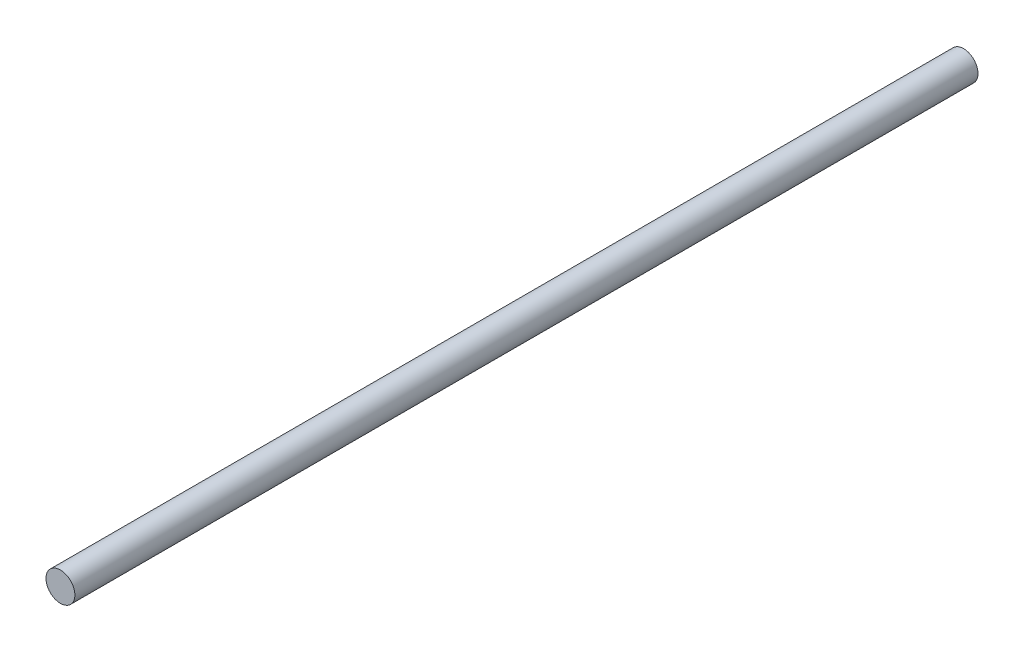
ISO-10303-21;
HEADER;
FILE_DESCRIPTION(('STEP AP214'),'2;1');
FILE_NAME('part.step','',(''),(''),'','','');
FILE_SCHEMA(('AUTOMOTIVE_DESIGN { 1 0 10303 214 1 1 1 1 }'));
ENDSEC;
DATA;
#1=APPLICATION_CONTEXT('core data for automotive mechanical design processes');
#2=APPLICATION_PROTOCOL_DEFINITION('international standard','automotive_design',2000,#1);
#3=PRODUCT_CONTEXT('',#1,'mechanical');
#4=PRODUCT('Part','Part','',(#3));
#5=PRODUCT_RELATED_PRODUCT_CATEGORY('part','',(#4));
#6=PRODUCT_DEFINITION_FORMATION('','',#4);
#7=PRODUCT_DEFINITION_CONTEXT('part definition',#1,'design');
#8=PRODUCT_DEFINITION('design','',#6,#7);
#9=PRODUCT_DEFINITION_SHAPE('','',#8);
#10=(LENGTH_UNIT() NAMED_UNIT(*) SI_UNIT(.MILLI.,.METRE.));
#11=(NAMED_UNIT(*) PLANE_ANGLE_UNIT() SI_UNIT($,.RADIAN.));
#12=(NAMED_UNIT(*) SI_UNIT($,.STERADIAN.) SOLID_ANGLE_UNIT());
#13=UNCERTAINTY_MEASURE_WITH_UNIT(LENGTH_MEASURE(1.E-05),#10,'distance_accuracy_value','');
#14=(GEOMETRIC_REPRESENTATION_CONTEXT(3) GLOBAL_UNCERTAINTY_ASSIGNED_CONTEXT((#13)) GLOBAL_UNIT_ASSIGNED_CONTEXT((#10,
#11,#12)) REPRESENTATION_CONTEXT('',''));
#15=CARTESIAN_POINT('',(0.,0.,0.));
#16=DIRECTION('',(0.,0.,1.));
#17=DIRECTION('',(1.,0.,0.));
#18=AXIS2_PLACEMENT_3D('',#15,#16,#17);
#19=CARTESIAN_POINT('',(0.,0.,250.));
#20=DIRECTION('',(0.,0.,-1.));
#21=DIRECTION('',(-1.,0.,0.));
#22=AXIS2_PLACEMENT_3D('',#19,#20,#21);
#23=CYLINDRICAL_SURFACE('',#22,4.);
#24=CARTESIAN_POINT('',(0.,0.,250.));
#25=DIRECTION('',(0.,0.,1.));
#26=DIRECTION('',(1.,0.,0.));
#27=AXIS2_PLACEMENT_3D('',#24,#25,#26);
#28=CIRCLE('',#27,4.);
#29=CARTESIAN_POINT('',(4.,0.,250.));
#30=VERTEX_POINT('',#29);
#31=EDGE_CURVE('E10',#30,#30,#28,.T.);
#32=ORIENTED_EDGE('',*,*,#31,.F.);
#33=EDGE_LOOP('',(#32));
#34=FACE_BOUND('',#33,.T.);
#35=CARTESIAN_POINT('',(0.,0.,0.));
#36=DIRECTION('',(0.,0.,1.));
#37=DIRECTION('',(1.,0.,0.));
#38=AXIS2_PLACEMENT_3D('',#35,#36,#37);
#39=CIRCLE('',#38,4.);
#40=CARTESIAN_POINT('',(4.,0.,0.));
#41=VERTEX_POINT('',#40);
#42=EDGE_CURVE('E34',#41,#41,#39,.T.);
#43=ORIENTED_EDGE('',*,*,#42,.T.);
#44=EDGE_LOOP('',(#43));
#45=FACE_BOUND('',#44,.T.);
#46=ADVANCED_FACE('F31',(#34,#45),#23,.T.);
#47=CARTESIAN_POINT('',(0.,0.,250.));
#48=DIRECTION('',(0.,0.,1.));
#49=DIRECTION('',(1.,0.,0.));
#50=AXIS2_PLACEMENT_3D('',#47,#48,#49);
#51=PLANE('',#50);
#52=ORIENTED_EDGE('',*,*,#31,.T.);
#53=EDGE_LOOP('',(#52));
#54=FACE_BOUND('',#53,.T.);
#55=ADVANCED_FACE('F46',(#54),#51,.T.);
#56=CARTESIAN_POINT('',(0.,0.,0.));
#57=DIRECTION('',(0.,0.,1.));
#58=DIRECTION('',(1.,0.,0.));
#59=AXIS2_PLACEMENT_3D('',#56,#57,#58);
#60=PLANE('',#59);
#61=ORIENTED_EDGE('',*,*,#42,.F.);
#62=EDGE_LOOP('',(#61));
#63=FACE_BOUND('',#62,.T.);
#64=ADVANCED_FACE('F44',(#63),#60,.F.);
#65=CLOSED_SHELL('',(#46,#55,#64));
#66=MANIFOLD_SOLID_BREP('B2',#65);
#67=ADVANCED_BREP_SHAPE_REPRESENTATION('',(#18,#66),#14);
#68=SHAPE_DEFINITION_REPRESENTATION(#9,#67);
ENDSEC;
END-ISO-10303-21;
